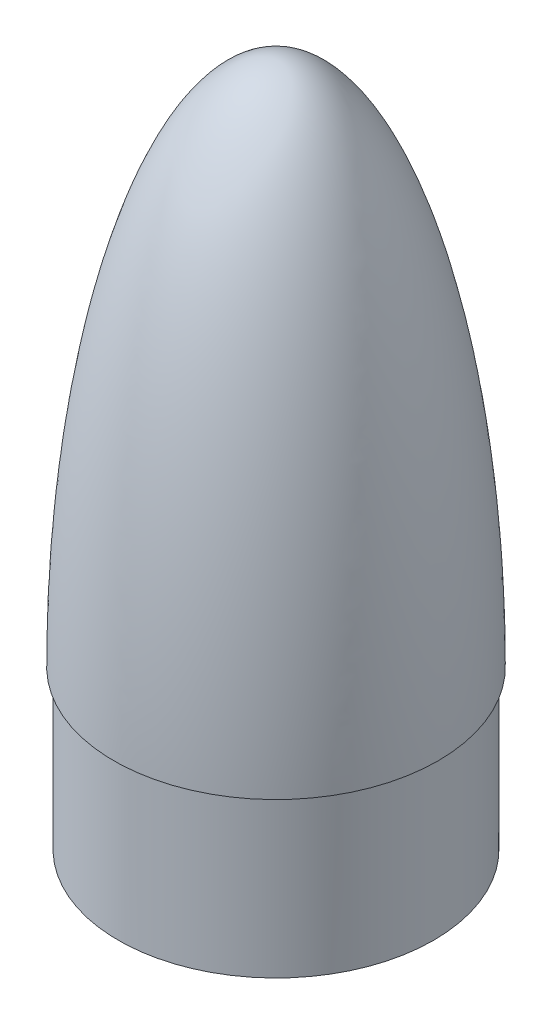
ISO-10303-21;
HEADER;
FILE_DESCRIPTION(('STEP AP214'),'2;1');
FILE_NAME('part.step','',(''),(''),'','','');
FILE_SCHEMA(('AUTOMOTIVE_DESIGN { 1 0 10303 214 1 1 1 1 }'));
ENDSEC;
DATA;
#1=APPLICATION_CONTEXT('core data for automotive mechanical design processes');
#2=APPLICATION_PROTOCOL_DEFINITION('international standard','automotive_design',2000,#1);
#3=PRODUCT_CONTEXT('',#1,'mechanical');
#4=PRODUCT('Part','Part','',(#3));
#5=PRODUCT_RELATED_PRODUCT_CATEGORY('part','',(#4));
#6=PRODUCT_DEFINITION_FORMATION('','',#4);
#7=PRODUCT_DEFINITION_CONTEXT('part definition',#1,'design');
#8=PRODUCT_DEFINITION('design','',#6,#7);
#9=PRODUCT_DEFINITION_SHAPE('','',#8);
#10=(LENGTH_UNIT() NAMED_UNIT(*) SI_UNIT(.MILLI.,.METRE.));
#11=(NAMED_UNIT(*) PLANE_ANGLE_UNIT() SI_UNIT($,.RADIAN.));
#12=(NAMED_UNIT(*) SI_UNIT($,.STERADIAN.) SOLID_ANGLE_UNIT());
#13=UNCERTAINTY_MEASURE_WITH_UNIT(LENGTH_MEASURE(1.E-05),#10,'distance_accuracy_value','');
#14=(GEOMETRIC_REPRESENTATION_CONTEXT(3) GLOBAL_UNCERTAINTY_ASSIGNED_CONTEXT((#13)) GLOBAL_UNIT_ASSIGNED_CONTEXT((#10,
#11,#12)) REPRESENTATION_CONTEXT('',''));
#15=CARTESIAN_POINT('',(0.,0.,0.));
#16=DIRECTION('',(0.,0.,1.));
#17=DIRECTION('',(1.,0.,0.));
#18=AXIS2_PLACEMENT_3D('',#15,#16,#17);
#19=CARTESIAN_POINT('',(78.359,-3.85531494606734E-12,0.));
#20=CARTESIAN_POINT('',(78.359,0.547287489068982,0.));
#21=CARTESIAN_POINT('',(78.3578456020913,1.64956361843462,0.));
#22=CARTESIAN_POINT('',(78.3526507757177,3.58634987508667,0.));
#23=CARTESIAN_POINT('',(78.3387963460281,5.98893459645597,0.));
#24=CARTESIAN_POINT('',(78.3180106719865,8.35221156859417,0.));
#25=CARTESIAN_POINT('',(78.2902889503954,10.7456008880195,0.));
#26=CARTESIAN_POINT('',(78.246958697056,13.7314118256161,0.));
#27=CARTESIAN_POINT('',(78.1810613065712,17.3117033815765,0.));
#28=CARTESIAN_POINT('',(78.0838662599076,21.4904424666151,0.));
#29=CARTESIAN_POINT('',(77.9448220852114,26.2641170070925,0.));
#30=CARTESIAN_POINT('',(77.7776831858623,31.0375576311523,0.));
#31=CARTESIAN_POINT('',(77.5822913396883,35.809557456187,0.));
#32=CARTESIAN_POINT('',(77.3584604389541,40.5805118631419,0.));
#33=CARTESIAN_POINT('',(77.0428534871404,46.5422862456341,0.));
#34=CARTESIAN_POINT('',(76.679080298482,52.501436143572,0.));
#35=CARTESIAN_POINT('',(76.2664485683162,58.4573591266812,0.));
#36=CARTESIAN_POINT('',(75.8041028056292,64.4096073986886,0.));
#37=CARTESIAN_POINT('',(75.4040152278983,69.1689496368448,0.));
#38=CARTESIAN_POINT('',(74.8656269280594,75.1147987012529,0.));
#39=CARTESIAN_POINT('',(74.1573857441951,82.2439739930946,0.));
#40=CARTESIAN_POINT('',(73.2382669176931,90.5517309552909,0.));
#41=CARTESIAN_POINT('',(72.0557405970124,100.030771810991,0.));
#42=CARTESIAN_POINT('',(70.7355289433761,109.491671533568,0.));
#43=CARTESIAN_POINT('',(69.2709291178535,118.931305028335,0.));
#44=CARTESIAN_POINT('',(67.2499969191818,130.699881306185,0.));
#45=CARTESIAN_POINT('',(64.5017329483004,144.7638404267,0.));
#46=CARTESIAN_POINT('',(61.308555538234,158.735984092228,0.));
#47=CARTESIAN_POINT('',(57.5910494958651,172.577213573773,0.));
#48=CARTESIAN_POINT('',(53.3830259383034,186.275905478554,0.));
#49=CARTESIAN_POINT('',(49.2387463120402,198.044837448591,0.));
#50=CARTESIAN_POINT('',(44.4832374304626,209.587335710966,0.));
#51=CARTESIAN_POINT('',(38.9428842352643,220.719241790214,0.));
#52=CARTESIAN_POINT('',(34.256173134855,228.693595393137,0.));
#53=CARTESIAN_POINT('',(29.8187102480322,235.095423042009,0.));
#54=CARTESIAN_POINT('',(25.6242497322616,240.182852142876,0.));
#55=CARTESIAN_POINT('',(21.9788928349695,243.926180276415,0.));
#56=CARTESIAN_POINT('',(18.5701501967581,246.859542722685,0.));
#57=CARTESIAN_POINT('',(15.4743490805522,249.076247660611,0.));
#58=CARTESIAN_POINT('',(12.5634057109101,250.785701438334,0.));
#59=CARTESIAN_POINT('',(9.77232736304578,252.083533870498,0.));
#60=CARTESIAN_POINT('',(7.06306970862825,253.028642362375,0.));
#61=CARTESIAN_POINT('',(4.27537380497181,253.686778480704,0.));
#62=CARTESIAN_POINT('',(2.18800688606533,253.939891173319,0.));
#63=CARTESIAN_POINT('',(0.767171585554607,253.999916554778,0.));
#64=CARTESIAN_POINT('',(0.,254.000000000054,0.));
#65=B_SPLINE_CURVE_WITH_KNOTS('',4,(#19,#20,#21,#22,#23,#24,#25,#26,#27,#28,#29,#30,#31,#32,#33,
#34,#35,#36,#37,#38,#39,#40,#41,#42,#43,#44,#45,#46,#47,#48,#49,#50,#51,#52,#53,#54,#55,#56,#57,
#58,#59,#60,#61,#62,#63,#64),.UNSPECIFIED.,.F.,.F.,(5,1,1,1,1,1,1,1,1,1,1,1,1,1,1,1,1,1,1,1,1,1,
1,1,1,1,1,1,1,1,1,1,1,1,1,1,1,1,1,1,1,1,5),(0.0832901678974378,0.0911196738198312,
0.0989491797422246,0.106778685664618,0.114608191587011,0.122437697509405,0.130267203431798,
0.145926215276585,0.161585227308661,0.177244239340738,0.192903251372814,0.208562263404891,
0.22422127500536,0.23988028660583,0.271198309806769,0.286857322025267,0.302516334243765,
0.318175346462263,0.333834358680761,0.365152382658847,0.396470406636932,0.427788430031848,
0.459106453426764,0.490424474288177,0.52174249514959,0.584378539310645,0.64701458132928,
0.678332609009811,0.709650636690343,0.772286631173186,0.810589211116004,0.841907031493423,
0.87260750281029,0.893486158308834,0.912628449807464,0.928287273750051,0.941044947751305,
0.952387223266141,0.962498308196118,0.972496120469674,0.981348672389275,0.98994985578346,1.),.UNSPECIFIED.);
#66=CARTESIAN_POINT('',(0.,254.000000000054,0.));
#67=DIRECTION('',(0.,1.,0.));
#68=AXIS1_PLACEMENT('',#66,#67);
#69=SURFACE_OF_REVOLUTION('',#65,#68);
#70=CARTESIAN_POINT('',(0.,254.000000000054,0.));
#71=VERTEX_POINT('',#70);
#72=VERTEX_LOOP('',#71);
#73=FACE_BOUND('',#72,.T.);
#74=CARTESIAN_POINT('',(0.,0.,0.));
#75=DIRECTION('',(0.,1.,0.));
#76=DIRECTION('',(-1.,0.,0.));
#77=AXIS2_PLACEMENT_3D('',#74,#75,#76);
#78=CIRCLE('',#77,78.359);
#79=CARTESIAN_POINT('',(-78.359,0.,0.));
#80=VERTEX_POINT('',#79);
#81=EDGE_CURVE('E48',#80,#80,#78,.T.);
#82=ORIENTED_EDGE('',*,*,#81,.T.);
#83=EDGE_LOOP('',(#82));
#84=FACE_BOUND('',#83,.T.);
#85=ADVANCED_FACE('F41',(#73,#84),#69,.T.);
#86=CARTESIAN_POINT('',(78.359,0.,0.));
#87=DIRECTION('',(0.,1.,0.));
#88=DIRECTION('',(-1.,0.,0.));
#89=AXIS2_PLACEMENT_3D('',#86,#87,#88);
#90=PLANE('',#89);
#91=CARTESIAN_POINT('',(0.,0.,0.));
#92=DIRECTION('',(0.,1.,0.));
#93=DIRECTION('',(-1.,0.,0.));
#94=AXIS2_PLACEMENT_3D('',#91,#92,#93);
#95=CIRCLE('',#94,76.2);
#96=CARTESIAN_POINT('',(-76.2,0.,0.));
#97=VERTEX_POINT('',#96);
#98=EDGE_CURVE('E11',#97,#97,#95,.F.);
#99=ORIENTED_EDGE('',*,*,#98,.F.);
#100=EDGE_LOOP('',(#99));
#101=FACE_BOUND('',#100,.T.);
#102=ORIENTED_EDGE('',*,*,#81,.F.);
#103=EDGE_LOOP('',(#102));
#104=FACE_BOUND('',#103,.T.);
#105=ADVANCED_FACE('F53',(#101,#104),#90,.F.);
#106=CARTESIAN_POINT('',(0.,-76.2,0.));
#107=DIRECTION('',(0.,1.,0.));
#108=DIRECTION('',(-1.,0.,0.));
#109=AXIS2_PLACEMENT_3D('',#106,#107,#108);
#110=CYLINDRICAL_SURFACE('',#109,76.2);
#111=CARTESIAN_POINT('',(0.,-76.2,0.));
#112=DIRECTION('',(0.,-1.,0.));
#113=DIRECTION('',(1.,0.,0.));
#114=AXIS2_PLACEMENT_3D('',#111,#112,#113);
#115=CIRCLE('',#114,76.2);
#116=CARTESIAN_POINT('',(76.2,-76.2,0.));
#117=VERTEX_POINT('',#116);
#118=EDGE_CURVE('E57',#117,#117,#115,.T.);
#119=ORIENTED_EDGE('',*,*,#118,.F.);
#120=EDGE_LOOP('',(#119));
#121=FACE_BOUND('',#120,.T.);
#122=ORIENTED_EDGE('',*,*,#98,.T.);
#123=EDGE_LOOP('',(#122));
#124=FACE_BOUND('',#123,.T.);
#125=ADVANCED_FACE('F70',(#121,#124),#110,.T.);
#126=CARTESIAN_POINT('',(0.,-76.2,0.));
#127=DIRECTION('',(0.,-1.,0.));
#128=DIRECTION('',(1.,0.,0.));
#129=AXIS2_PLACEMENT_3D('',#126,#127,#128);
#130=PLANE('',#129);
#131=ORIENTED_EDGE('',*,*,#118,.T.);
#132=EDGE_LOOP('',(#131));
#133=FACE_BOUND('',#132,.T.);
#134=ADVANCED_FACE('F68',(#133),#130,.T.);
#135=CLOSED_SHELL('',(#85,#105,#125,#134));
#136=MANIFOLD_SOLID_BREP('B2',#135);
#137=ADVANCED_BREP_SHAPE_REPRESENTATION('',(#18,#136),#14);
#138=SHAPE_DEFINITION_REPRESENTATION(#9,#137);
ENDSEC;
END-ISO-10303-21;
